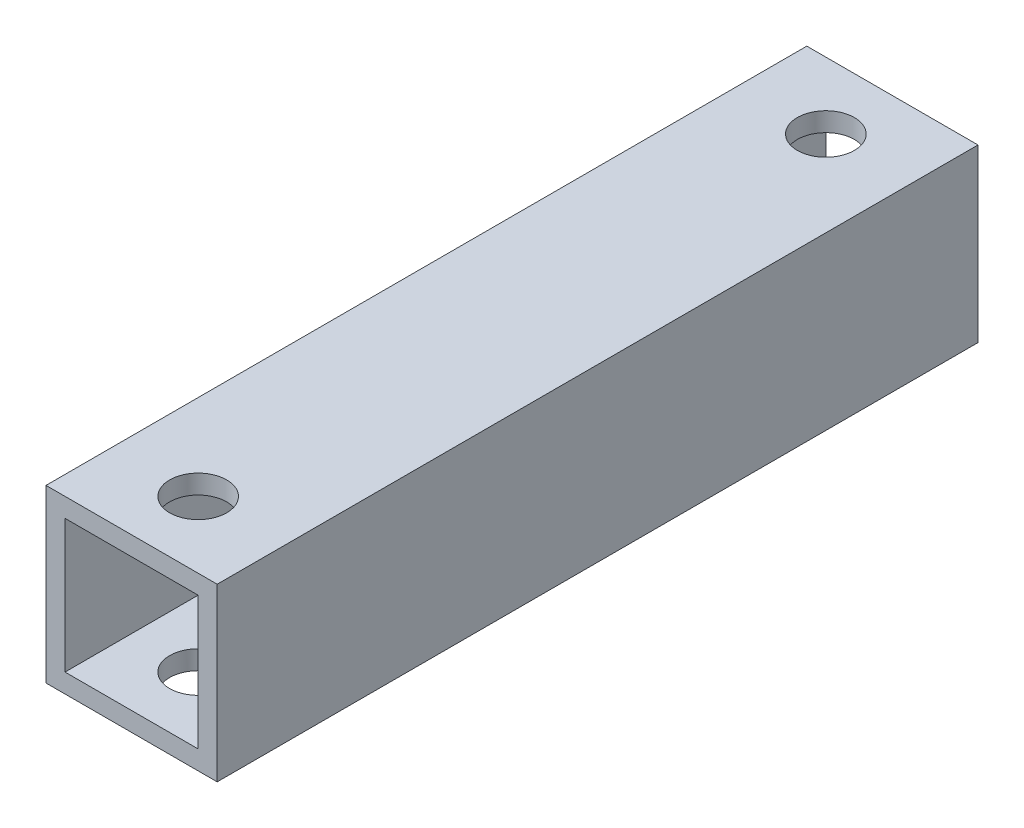
ISO-10303-21;
HEADER;
FILE_DESCRIPTION(('STEP AP214'),'2;1');
FILE_NAME('part.step','',(''),(''),'','','');
FILE_SCHEMA(('AUTOMOTIVE_DESIGN { 1 0 10303 214 1 1 1 1 }'));
ENDSEC;
DATA;
#1=APPLICATION_CONTEXT('core data for automotive mechanical design processes');
#2=APPLICATION_PROTOCOL_DEFINITION('international standard','automotive_design',2000,#1);
#3=PRODUCT_CONTEXT('',#1,'mechanical');
#4=PRODUCT('Part','Part','',(#3));
#5=PRODUCT_RELATED_PRODUCT_CATEGORY('part','',(#4));
#6=PRODUCT_DEFINITION_FORMATION('','',#4);
#7=PRODUCT_DEFINITION_CONTEXT('part definition',#1,'design');
#8=PRODUCT_DEFINITION('design','',#6,#7);
#9=PRODUCT_DEFINITION_SHAPE('','',#8);
#10=(LENGTH_UNIT() NAMED_UNIT(*) SI_UNIT(.MILLI.,.METRE.));
#11=(NAMED_UNIT(*) PLANE_ANGLE_UNIT() SI_UNIT($,.RADIAN.));
#12=(NAMED_UNIT(*) SI_UNIT($,.STERADIAN.) SOLID_ANGLE_UNIT());
#13=UNCERTAINTY_MEASURE_WITH_UNIT(LENGTH_MEASURE(1.E-05),#10,'distance_accuracy_value','');
#14=(GEOMETRIC_REPRESENTATION_CONTEXT(3) GLOBAL_UNCERTAINTY_ASSIGNED_CONTEXT((#13)) GLOBAL_UNIT_ASSIGNED_CONTEXT((#10,
#11,#12)) REPRESENTATION_CONTEXT('',''));
#15=CARTESIAN_POINT('',(0.,0.,0.));
#16=DIRECTION('',(0.,0.,1.));
#17=DIRECTION('',(1.,0.,0.));
#18=AXIS2_PLACEMENT_3D('',#15,#16,#17);
#19=CARTESIAN_POINT('',(4.5,4.5,40.));
#20=DIRECTION('',(-1.,0.,0.));
#21=DIRECTION('',(0.,0.,1.));
#22=AXIS2_PLACEMENT_3D('',#19,#20,#21);
#23=PLANE('',#22);
#24=DIRECTION('',(0.,1.,0.));
#25=VECTOR('',#24,1.);
#26=CARTESIAN_POINT('',(4.5,4.5,0.));
#27=LINE('',#26,#25);
#28=CARTESIAN_POINT('',(4.5,-4.5,0.));
#29=VERTEX_POINT('',#28);
#30=CARTESIAN_POINT('',(4.5,4.5,0.));
#31=VERTEX_POINT('',#30);
#32=EDGE_CURVE('E135',#29,#31,#27,.T.);
#33=ORIENTED_EDGE('',*,*,#32,.T.);
#34=DIRECTION('',(0.,0.,-1.));
#35=VECTOR('',#34,1.);
#36=CARTESIAN_POINT('',(4.5,4.5,40.));
#37=LINE('',#36,#35);
#38=CARTESIAN_POINT('',(4.5,4.5,40.));
#39=VERTEX_POINT('',#38);
#40=EDGE_CURVE('E11',#39,#31,#37,.T.);
#41=ORIENTED_EDGE('',*,*,#40,.F.);
#42=DIRECTION('',(0.,1.,0.));
#43=VECTOR('',#42,1.);
#44=CARTESIAN_POINT('',(4.5,4.5,40.));
#45=LINE('',#44,#43);
#46=CARTESIAN_POINT('',(4.5,-4.5,40.));
#47=VERTEX_POINT('',#46);
#48=EDGE_CURVE('E139',#47,#39,#45,.T.);
#49=ORIENTED_EDGE('',*,*,#48,.F.);
#50=DIRECTION('',(0.,0.,-1.));
#51=VECTOR('',#50,1.);
#52=CARTESIAN_POINT('',(4.5,-4.5,40.));
#53=LINE('',#52,#51);
#54=EDGE_CURVE('E149',#47,#29,#53,.T.);
#55=ORIENTED_EDGE('',*,*,#54,.T.);
#56=EDGE_LOOP('',(#33,#41,#49,#55));
#57=FACE_BOUND('',#56,.T.);
#58=ADVANCED_FACE('F33',(#57),#23,.F.);
#59=CARTESIAN_POINT('',(-4.5,4.5,40.));
#60=DIRECTION('',(0.,-1.,0.));
#61=DIRECTION('',(0.,0.,-1.));
#62=AXIS2_PLACEMENT_3D('',#59,#60,#61);
#63=PLANE('',#62);
#64=CARTESIAN_POINT('',(0.,4.5,3.5));
#65=DIRECTION('',(0.,1.,0.));
#66=DIRECTION('',(0.,0.,1.));
#67=AXIS2_PLACEMENT_3D('',#64,#65,#66);
#68=CIRCLE('',#67,1.5);
#69=CARTESIAN_POINT('',(0.,4.5,5.));
#70=VERTEX_POINT('',#69);
#71=EDGE_CURVE('E166',#70,#70,#68,.T.);
#72=ORIENTED_EDGE('',*,*,#71,.F.);
#73=EDGE_LOOP('',(#72));
#74=FACE_BOUND('',#73,.T.);
#75=CARTESIAN_POINT('',(0.,4.5,36.5));
#76=DIRECTION('',(0.,1.,0.));
#77=DIRECTION('',(0.,0.,1.));
#78=AXIS2_PLACEMENT_3D('',#75,#76,#77);
#79=CIRCLE('',#78,1.5);
#80=CARTESIAN_POINT('',(0.,4.5,38.));
#81=VERTEX_POINT('',#80);
#82=EDGE_CURVE('E173',#81,#81,#79,.T.);
#83=ORIENTED_EDGE('',*,*,#82,.F.);
#84=EDGE_LOOP('',(#83));
#85=FACE_BOUND('',#84,.T.);
#86=DIRECTION('',(-1.,0.,0.));
#87=VECTOR('',#86,1.);
#88=CARTESIAN_POINT('',(-4.5,4.5,0.));
#89=LINE('',#88,#87);
#90=CARTESIAN_POINT('',(-4.5,4.5,0.));
#91=VERTEX_POINT('',#90);
#92=EDGE_CURVE('E152',#31,#91,#89,.T.);
#93=ORIENTED_EDGE('',*,*,#92,.T.);
#94=DIRECTION('',(0.,0.,-1.));
#95=VECTOR('',#94,1.);
#96=CARTESIAN_POINT('',(-4.5,4.5,40.));
#97=LINE('',#96,#95);
#98=CARTESIAN_POINT('',(-4.5,4.5,40.));
#99=VERTEX_POINT('',#98);
#100=EDGE_CURVE('E41',#99,#91,#97,.T.);
#101=ORIENTED_EDGE('',*,*,#100,.F.);
#102=DIRECTION('',(-1.,0.,0.));
#103=VECTOR('',#102,1.);
#104=CARTESIAN_POINT('',(-4.5,4.5,40.));
#105=LINE('',#104,#103);
#106=EDGE_CURVE('E142',#39,#99,#105,.T.);
#107=ORIENTED_EDGE('',*,*,#106,.F.);
#108=ORIENTED_EDGE('',*,*,#40,.T.);
#109=EDGE_LOOP('',(#93,#101,#107,#108));
#110=FACE_BOUND('',#109,.T.);
#111=ADVANCED_FACE('F206',(#74,#85,#110),#63,.F.);
#112=CARTESIAN_POINT('',(-4.5,4.5,40.));
#113=DIRECTION('',(1.,0.,0.));
#114=DIRECTION('',(0.,0.,-1.));
#115=AXIS2_PLACEMENT_3D('',#112,#113,#114);
#116=PLANE('',#115);
#117=DIRECTION('',(0.,-1.,0.));
#118=VECTOR('',#117,1.);
#119=CARTESIAN_POINT('',(-4.5,4.5,0.));
#120=LINE('',#119,#118);
#121=CARTESIAN_POINT('',(-4.5,-4.5,0.));
#122=VERTEX_POINT('',#121);
#123=EDGE_CURVE('E154',#91,#122,#120,.T.);
#124=ORIENTED_EDGE('',*,*,#123,.T.);
#125=DIRECTION('',(0.,0.,-1.));
#126=VECTOR('',#125,1.);
#127=CARTESIAN_POINT('',(-4.5,-4.5,40.));
#128=LINE('',#127,#126);
#129=CARTESIAN_POINT('',(-4.5,-4.5,40.));
#130=VERTEX_POINT('',#129);
#131=EDGE_CURVE('E159',#130,#122,#128,.T.);
#132=ORIENTED_EDGE('',*,*,#131,.F.);
#133=DIRECTION('',(0.,-1.,0.));
#134=VECTOR('',#133,1.);
#135=CARTESIAN_POINT('',(-4.5,4.5,40.));
#136=LINE('',#135,#134);
#137=EDGE_CURVE('E145',#99,#130,#136,.T.);
#138=ORIENTED_EDGE('',*,*,#137,.F.);
#139=ORIENTED_EDGE('',*,*,#100,.T.);
#140=EDGE_LOOP('',(#124,#132,#138,#139));
#141=FACE_BOUND('',#140,.T.);
#142=ADVANCED_FACE('F211',(#141),#116,.F.);
#143=CARTESIAN_POINT('',(-4.5,-4.5,40.));
#144=DIRECTION('',(0.,1.,0.));
#145=DIRECTION('',(0.,0.,1.));
#146=AXIS2_PLACEMENT_3D('',#143,#144,#145);
#147=PLANE('',#146);
#148=CARTESIAN_POINT('',(0.,-4.5,3.5));
#149=DIRECTION('',(0.,1.,0.));
#150=DIRECTION('',(0.,0.,1.));
#151=AXIS2_PLACEMENT_3D('',#148,#149,#150);
#152=CIRCLE('',#151,1.5);
#153=CARTESIAN_POINT('',(0.,-4.5,5.));
#154=VERTEX_POINT('',#153);
#155=EDGE_CURVE('E123',#154,#154,#152,.T.);
#156=ORIENTED_EDGE('',*,*,#155,.T.);
#157=EDGE_LOOP('',(#156));
#158=FACE_BOUND('',#157,.T.);
#159=CARTESIAN_POINT('',(0.,-4.5,36.5));
#160=DIRECTION('',(0.,1.,0.));
#161=DIRECTION('',(0.,0.,1.));
#162=AXIS2_PLACEMENT_3D('',#159,#160,#161);
#163=CIRCLE('',#162,1.5);
#164=CARTESIAN_POINT('',(0.,-4.5,38.));
#165=VERTEX_POINT('',#164);
#166=EDGE_CURVE('E170',#165,#165,#163,.T.);
#167=ORIENTED_EDGE('',*,*,#166,.T.);
#168=EDGE_LOOP('',(#167));
#169=FACE_BOUND('',#168,.T.);
#170=DIRECTION('',(1.,0.,0.));
#171=VECTOR('',#170,1.);
#172=CARTESIAN_POINT('',(-4.5,-4.5,0.));
#173=LINE('',#172,#171);
#174=EDGE_CURVE('E143',#122,#29,#173,.T.);
#175=ORIENTED_EDGE('',*,*,#174,.T.);
#176=ORIENTED_EDGE('',*,*,#54,.F.);
#177=DIRECTION('',(1.,0.,0.));
#178=VECTOR('',#177,1.);
#179=CARTESIAN_POINT('',(-4.5,-4.5,40.));
#180=LINE('',#179,#178);
#181=EDGE_CURVE('E147',#130,#47,#180,.T.);
#182=ORIENTED_EDGE('',*,*,#181,.F.);
#183=ORIENTED_EDGE('',*,*,#131,.T.);
#184=EDGE_LOOP('',(#175,#176,#182,#183));
#185=FACE_BOUND('',#184,.T.);
#186=ADVANCED_FACE('F227',(#158,#169,#185),#147,.F.);
#187=CARTESIAN_POINT('',(0.,0.,40.));
#188=DIRECTION('',(0.,0.,1.));
#189=DIRECTION('',(1.,0.,0.));
#190=AXIS2_PLACEMENT_3D('',#187,#188,#189);
#191=PLANE('',#190);
#192=DIRECTION('',(0.,1.,0.));
#193=VECTOR('',#192,1.);
#194=CARTESIAN_POINT('',(3.5,3.5,40.));
#195=LINE('',#194,#193);
#196=CARTESIAN_POINT('',(3.5,-3.5,40.));
#197=VERTEX_POINT('',#196);
#198=CARTESIAN_POINT('',(3.5,3.5,40.));
#199=VERTEX_POINT('',#198);
#200=EDGE_CURVE('E49',#197,#199,#195,.T.);
#201=ORIENTED_EDGE('',*,*,#200,.F.);
#202=DIRECTION('',(1.,0.,0.));
#203=VECTOR('',#202,1.);
#204=CARTESIAN_POINT('',(-3.5,-3.5,40.));
#205=LINE('',#204,#203);
#206=CARTESIAN_POINT('',(-3.5,-3.5,40.));
#207=VERTEX_POINT('',#206);
#208=EDGE_CURVE('E117',#207,#197,#205,.T.);
#209=ORIENTED_EDGE('',*,*,#208,.F.);
#210=DIRECTION('',(0.,-1.,0.));
#211=VECTOR('',#210,1.);
#212=CARTESIAN_POINT('',(-3.5,3.5,40.));
#213=LINE('',#212,#211);
#214=CARTESIAN_POINT('',(-3.5,3.5,40.));
#215=VERTEX_POINT('',#214);
#216=EDGE_CURVE('E120',#215,#207,#213,.T.);
#217=ORIENTED_EDGE('',*,*,#216,.F.);
#218=DIRECTION('',(-1.,0.,0.));
#219=VECTOR('',#218,1.);
#220=CARTESIAN_POINT('',(-3.5,3.5,40.));
#221=LINE('',#220,#219);
#222=EDGE_CURVE('E129',#199,#215,#221,.T.);
#223=ORIENTED_EDGE('',*,*,#222,.F.);
#224=EDGE_LOOP('',(#201,#209,#217,#223));
#225=FACE_BOUND('',#224,.T.);
#226=ORIENTED_EDGE('',*,*,#48,.T.);
#227=ORIENTED_EDGE('',*,*,#106,.T.);
#228=ORIENTED_EDGE('',*,*,#137,.T.);
#229=ORIENTED_EDGE('',*,*,#181,.T.);
#230=EDGE_LOOP('',(#226,#227,#228,#229));
#231=FACE_BOUND('',#230,.T.);
#232=ADVANCED_FACE('F223',(#225,#231),#191,.T.);
#233=CARTESIAN_POINT('',(0.,0.,0.));
#234=DIRECTION('',(0.,0.,1.));
#235=DIRECTION('',(1.,0.,0.));
#236=AXIS2_PLACEMENT_3D('',#233,#234,#235);
#237=PLANE('',#236);
#238=DIRECTION('',(1.,0.,0.));
#239=VECTOR('',#238,1.);
#240=CARTESIAN_POINT('',(-3.5,-3.5,0.));
#241=LINE('',#240,#239);
#242=CARTESIAN_POINT('',(-3.5,-3.5,0.));
#243=VERTEX_POINT('',#242);
#244=CARTESIAN_POINT('',(3.5,-3.5,0.));
#245=VERTEX_POINT('',#244);
#246=EDGE_CURVE('E107',#243,#245,#241,.T.);
#247=ORIENTED_EDGE('',*,*,#246,.T.);
#248=DIRECTION('',(0.,1.,0.));
#249=VECTOR('',#248,1.);
#250=CARTESIAN_POINT('',(3.5,3.5,0.));
#251=LINE('',#250,#249);
#252=CARTESIAN_POINT('',(3.5,3.5,0.));
#253=VERTEX_POINT('',#252);
#254=EDGE_CURVE('E101',#245,#253,#251,.T.);
#255=ORIENTED_EDGE('',*,*,#254,.T.);
#256=DIRECTION('',(-1.,0.,0.));
#257=VECTOR('',#256,1.);
#258=CARTESIAN_POINT('',(-3.5,3.5,0.));
#259=LINE('',#258,#257);
#260=CARTESIAN_POINT('',(-3.5,3.5,0.));
#261=VERTEX_POINT('',#260);
#262=EDGE_CURVE('E110',#253,#261,#259,.T.);
#263=ORIENTED_EDGE('',*,*,#262,.T.);
#264=DIRECTION('',(0.,-1.,0.));
#265=VECTOR('',#264,1.);
#266=CARTESIAN_POINT('',(-3.5,3.5,0.));
#267=LINE('',#266,#265);
#268=EDGE_CURVE('E57',#261,#243,#267,.T.);
#269=ORIENTED_EDGE('',*,*,#268,.T.);
#270=EDGE_LOOP('',(#247,#255,#263,#269));
#271=FACE_BOUND('',#270,.T.);
#272=ORIENTED_EDGE('',*,*,#32,.F.);
#273=ORIENTED_EDGE('',*,*,#174,.F.);
#274=ORIENTED_EDGE('',*,*,#123,.F.);
#275=ORIENTED_EDGE('',*,*,#92,.F.);
#276=EDGE_LOOP('',(#272,#273,#274,#275));
#277=FACE_BOUND('',#276,.T.);
#278=ADVANCED_FACE('F114',(#271,#277),#237,.F.);
#279=CARTESIAN_POINT('',(3.5,3.5,0.));
#280=DIRECTION('',(1.,0.,0.));
#281=DIRECTION('',(0.,1.,0.));
#282=AXIS2_PLACEMENT_3D('',#279,#280,#281);
#283=PLANE('',#282);
#284=ORIENTED_EDGE('',*,*,#200,.T.);
#285=DIRECTION('',(0.,0.,1.));
#286=VECTOR('',#285,1.);
#287=CARTESIAN_POINT('',(3.5,3.5,0.));
#288=LINE('',#287,#286);
#289=EDGE_CURVE('E97',#253,#199,#288,.T.);
#290=ORIENTED_EDGE('',*,*,#289,.F.);
#291=ORIENTED_EDGE('',*,*,#254,.F.);
#292=DIRECTION('',(0.,0.,1.));
#293=VECTOR('',#292,1.);
#294=CARTESIAN_POINT('',(3.5,-3.5,0.));
#295=LINE('',#294,#293);
#296=EDGE_CURVE('E133',#245,#197,#295,.T.);
#297=ORIENTED_EDGE('',*,*,#296,.T.);
#298=EDGE_LOOP('',(#284,#290,#291,#297));
#299=FACE_BOUND('',#298,.T.);
#300=ADVANCED_FACE('F99',(#299),#283,.F.);
#301=CARTESIAN_POINT('',(-3.5,-3.5,0.));
#302=DIRECTION('',(0.,-1.,0.));
#303=DIRECTION('',(0.,0.,-1.));
#304=AXIS2_PLACEMENT_3D('',#301,#302,#303);
#305=PLANE('',#304);
#306=CARTESIAN_POINT('',(0.,-3.5,3.5));
#307=DIRECTION('',(0.,-1.,0.));
#308=DIRECTION('',(0.,0.,-1.));
#309=AXIS2_PLACEMENT_3D('',#306,#307,#308);
#310=CIRCLE('',#309,1.5);
#311=CARTESIAN_POINT('',(0.,-3.5,2.));
#312=VERTEX_POINT('',#311);
#313=EDGE_CURVE('E181',#312,#312,#310,.T.);
#314=ORIENTED_EDGE('',*,*,#313,.T.);
#315=EDGE_LOOP('',(#314));
#316=FACE_BOUND('',#315,.T.);
#317=CARTESIAN_POINT('',(0.,-3.5,36.5));
#318=DIRECTION('',(0.,-1.,0.));
#319=DIRECTION('',(0.,0.,-1.));
#320=AXIS2_PLACEMENT_3D('',#317,#318,#319);
#321=CIRCLE('',#320,1.5);
#322=CARTESIAN_POINT('',(0.,-3.5,35.));
#323=VERTEX_POINT('',#322);
#324=EDGE_CURVE('E165',#323,#323,#321,.T.);
#325=ORIENTED_EDGE('',*,*,#324,.T.);
#326=EDGE_LOOP('',(#325));
#327=FACE_BOUND('',#326,.T.);
#328=ORIENTED_EDGE('',*,*,#208,.T.);
#329=ORIENTED_EDGE('',*,*,#296,.F.);
#330=ORIENTED_EDGE('',*,*,#246,.F.);
#331=DIRECTION('',(0.,0.,1.));
#332=VECTOR('',#331,1.);
#333=CARTESIAN_POINT('',(-3.5,-3.5,0.));
#334=LINE('',#333,#332);
#335=EDGE_CURVE('E136',#243,#207,#334,.T.);
#336=ORIENTED_EDGE('',*,*,#335,.T.);
#337=EDGE_LOOP('',(#328,#329,#330,#336));
#338=FACE_BOUND('',#337,.T.);
#339=ADVANCED_FACE('F244',(#316,#327,#338),#305,.F.);
#340=CARTESIAN_POINT('',(-3.5,3.5,0.));
#341=DIRECTION('',(-1.,0.,0.));
#342=DIRECTION('',(0.,-1.,0.));
#343=AXIS2_PLACEMENT_3D('',#340,#341,#342);
#344=PLANE('',#343);
#345=ORIENTED_EDGE('',*,*,#216,.T.);
#346=ORIENTED_EDGE('',*,*,#335,.F.);
#347=ORIENTED_EDGE('',*,*,#268,.F.);
#348=DIRECTION('',(0.,0.,1.));
#349=VECTOR('',#348,1.);
#350=CARTESIAN_POINT('',(-3.5,3.5,0.));
#351=LINE('',#350,#349);
#352=EDGE_CURVE('E106',#261,#215,#351,.T.);
#353=ORIENTED_EDGE('',*,*,#352,.T.);
#354=EDGE_LOOP('',(#345,#346,#347,#353));
#355=FACE_BOUND('',#354,.T.);
#356=ADVANCED_FACE('F247',(#355),#344,.F.);
#357=CARTESIAN_POINT('',(-3.5,3.5,0.));
#358=DIRECTION('',(0.,1.,0.));
#359=DIRECTION('',(0.,0.,1.));
#360=AXIS2_PLACEMENT_3D('',#357,#358,#359);
#361=PLANE('',#360);
#362=CARTESIAN_POINT('',(0.,3.5,3.5));
#363=DIRECTION('',(0.,1.,0.));
#364=DIRECTION('',(0.,0.,1.));
#365=AXIS2_PLACEMENT_3D('',#362,#363,#364);
#366=CIRCLE('',#365,1.5);
#367=CARTESIAN_POINT('',(0.,3.5,5.));
#368=VERTEX_POINT('',#367);
#369=EDGE_CURVE('E36',#368,#368,#366,.T.);
#370=ORIENTED_EDGE('',*,*,#369,.T.);
#371=EDGE_LOOP('',(#370));
#372=FACE_BOUND('',#371,.T.);
#373=CARTESIAN_POINT('',(0.,3.5,36.5));
#374=DIRECTION('',(0.,1.,0.));
#375=DIRECTION('',(0.,0.,1.));
#376=AXIS2_PLACEMENT_3D('',#373,#374,#375);
#377=CIRCLE('',#376,1.5);
#378=CARTESIAN_POINT('',(0.,3.5,38.));
#379=VERTEX_POINT('',#378);
#380=EDGE_CURVE('E163',#379,#379,#377,.T.);
#381=ORIENTED_EDGE('',*,*,#380,.T.);
#382=EDGE_LOOP('',(#381));
#383=FACE_BOUND('',#382,.T.);
#384=ORIENTED_EDGE('',*,*,#222,.T.);
#385=ORIENTED_EDGE('',*,*,#352,.F.);
#386=ORIENTED_EDGE('',*,*,#262,.F.);
#387=ORIENTED_EDGE('',*,*,#289,.T.);
#388=EDGE_LOOP('',(#384,#385,#386,#387));
#389=FACE_BOUND('',#388,.T.);
#390=ADVANCED_FACE('F111',(#372,#383,#389),#361,.F.);
#391=CARTESIAN_POINT('',(0.,-33.5,36.5));
#392=DIRECTION('',(0.,1.,0.));
#393=DIRECTION('',(0.,0.,1.));
#394=AXIS2_PLACEMENT_3D('',#391,#392,#393);
#395=CYLINDRICAL_SURFACE('',#394,1.5);
#396=ORIENTED_EDGE('',*,*,#82,.T.);
#397=EDGE_LOOP('',(#396));
#398=FACE_BOUND('',#397,.T.);
#399=ORIENTED_EDGE('',*,*,#380,.F.);
#400=EDGE_LOOP('',(#399));
#401=FACE_BOUND('',#400,.T.);
#402=ADVANCED_FACE('F193',(#398,#401),#395,.F.);
#403=CARTESIAN_POINT('',(0.,-33.5,3.5));
#404=DIRECTION('',(0.,1.,0.));
#405=DIRECTION('',(0.,0.,1.));
#406=AXIS2_PLACEMENT_3D('',#403,#404,#405);
#407=CYLINDRICAL_SURFACE('',#406,1.5);
#408=ORIENTED_EDGE('',*,*,#71,.T.);
#409=EDGE_LOOP('',(#408));
#410=FACE_BOUND('',#409,.T.);
#411=ORIENTED_EDGE('',*,*,#369,.F.);
#412=EDGE_LOOP('',(#411));
#413=FACE_BOUND('',#412,.T.);
#414=ADVANCED_FACE('F190',(#410,#413),#407,.F.);
#415=ORIENTED_EDGE('',*,*,#324,.F.);
#416=EDGE_LOOP('',(#415));
#417=FACE_BOUND('',#416,.T.);
#418=ORIENTED_EDGE('',*,*,#166,.F.);
#419=EDGE_LOOP('',(#418));
#420=FACE_BOUND('',#419,.T.);
#421=ADVANCED_FACE('F192',(#417,#420),#395,.F.);
#422=ORIENTED_EDGE('',*,*,#313,.F.);
#423=EDGE_LOOP('',(#422));
#424=FACE_BOUND('',#423,.T.);
#425=ORIENTED_EDGE('',*,*,#155,.F.);
#426=EDGE_LOOP('',(#425));
#427=FACE_BOUND('',#426,.T.);
#428=ADVANCED_FACE('F195',(#424,#427),#407,.F.);
#429=CLOSED_SHELL('',(#58,#111,#142,#186,#232,#278,#300,#339,#356,#390,#402,#414,#421,#428));
#430=MANIFOLD_SOLID_BREP('B2',#429);
#431=ADVANCED_BREP_SHAPE_REPRESENTATION('',(#18,#430),#14);
#432=SHAPE_DEFINITION_REPRESENTATION(#9,#431);
ENDSEC;
END-ISO-10303-21;
